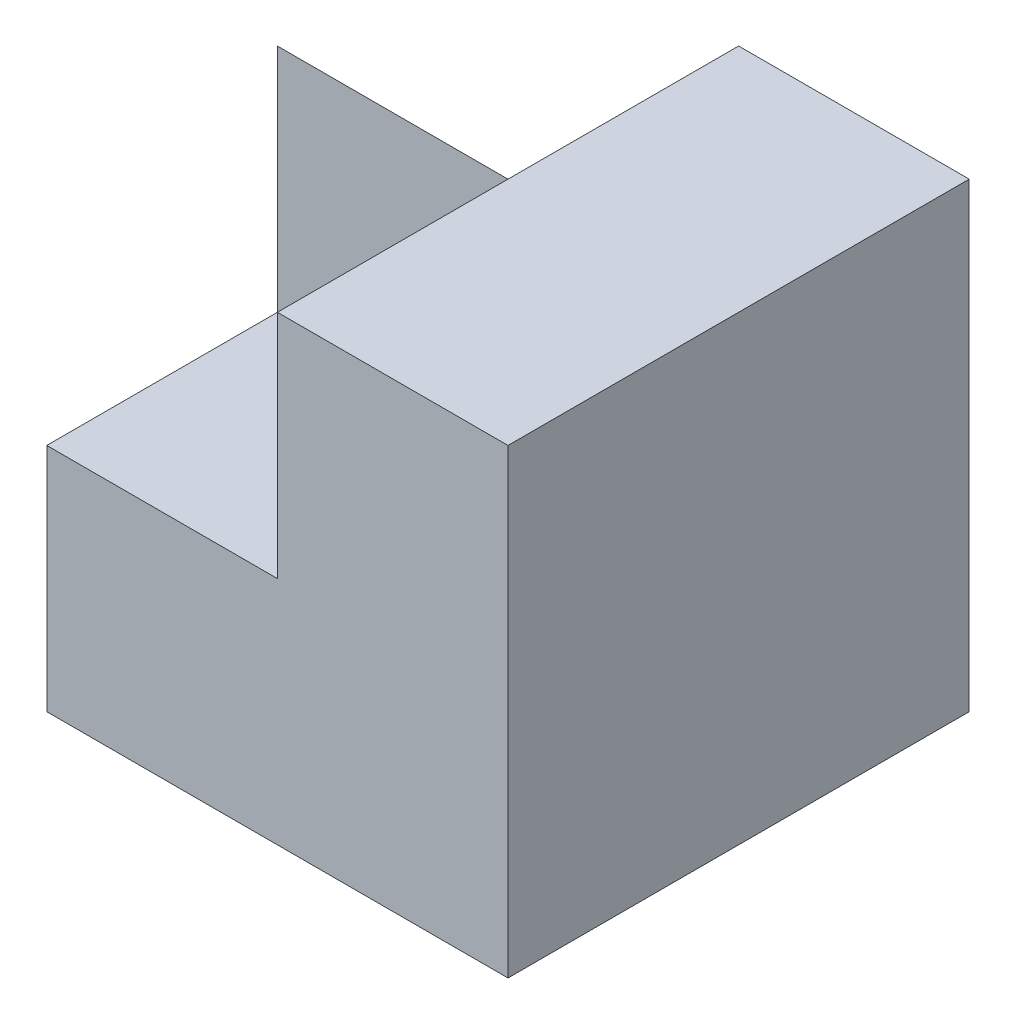
ISO-10303-21;
HEADER;
FILE_DESCRIPTION(('STEP AP214'),'2;1');
FILE_NAME('part.step','',(''),(''),'','','');
FILE_SCHEMA(('AUTOMOTIVE_DESIGN { 1 0 10303 214 1 1 1 1 }'));
ENDSEC;
DATA;
#1=APPLICATION_CONTEXT('core data for automotive mechanical design processes');
#2=APPLICATION_PROTOCOL_DEFINITION('international standard','automotive_design',2000,#1);
#3=PRODUCT_CONTEXT('',#1,'mechanical');
#4=PRODUCT('Part','Part','',(#3));
#5=PRODUCT_RELATED_PRODUCT_CATEGORY('part','',(#4));
#6=PRODUCT_DEFINITION_FORMATION('','',#4);
#7=PRODUCT_DEFINITION_CONTEXT('part definition',#1,'design');
#8=PRODUCT_DEFINITION('design','',#6,#7);
#9=PRODUCT_DEFINITION_SHAPE('','',#8);
#10=(LENGTH_UNIT() NAMED_UNIT(*) SI_UNIT(.MILLI.,.METRE.));
#11=(NAMED_UNIT(*) PLANE_ANGLE_UNIT() SI_UNIT($,.RADIAN.));
#12=(NAMED_UNIT(*) SI_UNIT($,.STERADIAN.) SOLID_ANGLE_UNIT());
#13=UNCERTAINTY_MEASURE_WITH_UNIT(LENGTH_MEASURE(1.E-05),#10,'distance_accuracy_value','');
#14=(GEOMETRIC_REPRESENTATION_CONTEXT(3) GLOBAL_UNCERTAINTY_ASSIGNED_CONTEXT((#13)) GLOBAL_UNIT_ASSIGNED_CONTEXT((#10,
#11,#12)) REPRESENTATION_CONTEXT('',''));
#15=CARTESIAN_POINT('',(0.,0.,0.));
#16=DIRECTION('',(0.,0.,1.));
#17=DIRECTION('',(1.,0.,0.));
#18=AXIS2_PLACEMENT_3D('',#15,#16,#17);
#19=CARTESIAN_POINT('',(0.,4.,0.));
#20=DIRECTION('',(0.,-1.,0.));
#21=DIRECTION('',(0.,0.,-1.));
#22=AXIS2_PLACEMENT_3D('',#19,#20,#21);
#23=PLANE('',#22);
#24=DIRECTION('',(0.,0.,-1.));
#25=VECTOR('',#24,1.);
#26=CARTESIAN_POINT('',(0.,4.,0.));
#27=LINE('',#26,#25);
#28=CARTESIAN_POINT('',(0.,4.,2.));
#29=VERTEX_POINT('',#28);
#30=CARTESIAN_POINT('',(0.,4.,0.));
#31=VERTEX_POINT('',#30);
#32=EDGE_CURVE('E68',#29,#31,#27,.T.);
#33=ORIENTED_EDGE('',*,*,#32,.F.);
#34=DIRECTION('',(1.,0.,0.));
#35=VECTOR('',#34,1.);
#36=CARTESIAN_POINT('',(-2.,4.,2.));
#37=LINE('',#36,#35);
#38=CARTESIAN_POINT('',(2.,4.,2.));
#39=VERTEX_POINT('',#38);
#40=EDGE_CURVE('E76',#29,#39,#37,.T.);
#41=ORIENTED_EDGE('',*,*,#40,.T.);
#42=DIRECTION('',(0.,0.,-1.));
#43=VECTOR('',#42,1.);
#44=CARTESIAN_POINT('',(2.,4.,2.));
#45=LINE('',#44,#43);
#46=CARTESIAN_POINT('',(2.,4.,-2.));
#47=VERTEX_POINT('',#46);
#48=EDGE_CURVE('E108',#39,#47,#45,.T.);
#49=ORIENTED_EDGE('',*,*,#48,.T.);
#50=DIRECTION('',(-1.,0.,0.));
#51=VECTOR('',#50,1.);
#52=CARTESIAN_POINT('',(-2.,4.,-2.));
#53=LINE('',#52,#51);
#54=CARTESIAN_POINT('',(0.,4.,-2.));
#55=VERTEX_POINT('',#54);
#56=EDGE_CURVE('E143',#47,#55,#53,.T.);
#57=ORIENTED_EDGE('',*,*,#56,.T.);
#58=DIRECTION('',(0.,0.,-1.));
#59=VECTOR('',#58,1.);
#60=CARTESIAN_POINT('',(0.,4.,0.));
#61=LINE('',#60,#59);
#62=EDGE_CURVE('E150',#31,#55,#61,.T.);
#63=ORIENTED_EDGE('',*,*,#62,.F.);
#64=EDGE_LOOP('',(#33,#41,#49,#57,#63));
#65=FACE_BOUND('',#64,.T.);
#66=ADVANCED_FACE('F53',(#65),#23,.F.);
#67=CARTESIAN_POINT('',(2.,4.,2.));
#68=DIRECTION('',(-1.,0.,0.));
#69=DIRECTION('',(0.,0.,1.));
#70=AXIS2_PLACEMENT_3D('',#67,#68,#69);
#71=PLANE('',#70);
#72=DIRECTION('',(0.,0.,-1.));
#73=VECTOR('',#72,1.);
#74=CARTESIAN_POINT('',(2.,0.,2.));
#75=LINE('',#74,#73);
#76=CARTESIAN_POINT('',(2.,0.,2.));
#77=VERTEX_POINT('',#76);
#78=CARTESIAN_POINT('',(2.,0.,-2.));
#79=VERTEX_POINT('',#78);
#80=EDGE_CURVE('E114',#77,#79,#75,.T.);
#81=ORIENTED_EDGE('',*,*,#80,.T.);
#82=DIRECTION('',(0.,-1.,0.));
#83=VECTOR('',#82,1.);
#84=CARTESIAN_POINT('',(2.,4.,-2.));
#85=LINE('',#84,#83);
#86=EDGE_CURVE('E12',#47,#79,#85,.T.);
#87=ORIENTED_EDGE('',*,*,#86,.F.);
#88=ORIENTED_EDGE('',*,*,#48,.F.);
#89=DIRECTION('',(0.,-1.,0.));
#90=VECTOR('',#89,1.);
#91=CARTESIAN_POINT('',(2.,4.,2.));
#92=LINE('',#91,#90);
#93=EDGE_CURVE('E99',#39,#77,#92,.T.);
#94=ORIENTED_EDGE('',*,*,#93,.T.);
#95=EDGE_LOOP('',(#81,#87,#88,#94));
#96=FACE_BOUND('',#95,.T.);
#97=ADVANCED_FACE('F55',(#96),#71,.F.);
#98=CARTESIAN_POINT('',(-2.,4.,-2.));
#99=DIRECTION('',(0.,0.,1.));
#100=DIRECTION('',(1.,0.,0.));
#101=AXIS2_PLACEMENT_3D('',#98,#99,#100);
#102=PLANE('',#101);
#103=DIRECTION('',(0.,-1.,0.));
#104=VECTOR('',#103,1.);
#105=CARTESIAN_POINT('',(-2.,4.,-2.));
#106=LINE('',#105,#104);
#107=CARTESIAN_POINT('',(-2.,2.,-2.));
#108=VERTEX_POINT('',#107);
#109=CARTESIAN_POINT('',(-2.,0.,-2.));
#110=VERTEX_POINT('',#109);
#111=EDGE_CURVE('E61',#108,#110,#106,.T.);
#112=ORIENTED_EDGE('',*,*,#111,.F.);
#113=DIRECTION('',(-1.,0.,0.));
#114=VECTOR('',#113,1.);
#115=CARTESIAN_POINT('',(0.,2.,-2.));
#116=LINE('',#115,#114);
#117=CARTESIAN_POINT('',(0.,2.,-2.));
#118=VERTEX_POINT('',#117);
#119=EDGE_CURVE('E123',#118,#108,#116,.T.);
#120=ORIENTED_EDGE('',*,*,#119,.F.);
#121=DIRECTION('',(0.,-1.,0.));
#122=VECTOR('',#121,1.);
#123=CARTESIAN_POINT('',(0.,0.,-2.));
#124=LINE('',#123,#122);
#125=EDGE_CURVE('E145',#55,#118,#124,.T.);
#126=ORIENTED_EDGE('',*,*,#125,.F.);
#127=ORIENTED_EDGE('',*,*,#56,.F.);
#128=ORIENTED_EDGE('',*,*,#86,.T.);
#129=DIRECTION('',(-1.,0.,0.));
#130=VECTOR('',#129,1.);
#131=CARTESIAN_POINT('',(-2.,0.,-2.));
#132=LINE('',#131,#130);
#133=EDGE_CURVE('E118',#79,#110,#132,.T.);
#134=ORIENTED_EDGE('',*,*,#133,.T.);
#135=EDGE_LOOP('',(#112,#120,#126,#127,#128,#134));
#136=FACE_BOUND('',#135,.T.);
#137=ADVANCED_FACE('F140',(#136),#102,.F.);
#138=CARTESIAN_POINT('',(-2.,4.,2.));
#139=DIRECTION('',(1.,0.,0.));
#140=DIRECTION('',(0.,0.,-1.));
#141=AXIS2_PLACEMENT_3D('',#138,#139,#140);
#142=PLANE('',#141);
#143=DIRECTION('',(0.,0.,1.));
#144=VECTOR('',#143,1.);
#145=CARTESIAN_POINT('',(-2.,2.,0.));
#146=LINE('',#145,#144);
#147=CARTESIAN_POINT('',(-2.,2.,0.));
#148=VERTEX_POINT('',#147);
#149=CARTESIAN_POINT('',(-2.,2.,2.));
#150=VERTEX_POINT('',#149);
#151=EDGE_CURVE('E164',#148,#150,#146,.T.);
#152=ORIENTED_EDGE('',*,*,#151,.F.);
#153=DIRECTION('',(0.,-1.,0.));
#154=VECTOR('',#153,1.);
#155=CARTESIAN_POINT('',(-2.,0.,0.));
#156=LINE('',#155,#154);
#157=CARTESIAN_POINT('',(-2.,4.,0.));
#158=VERTEX_POINT('',#157);
#159=EDGE_CURVE('E168',#158,#148,#156,.T.);
#160=ORIENTED_EDGE('',*,*,#159,.F.);
#161=DIRECTION('',(0.,0.707106781186548,0.707106781186548));
#162=VECTOR('',#161,1.);
#163=CARTESIAN_POINT('',(-2.,2.,-2.));
#164=LINE('',#163,#162);
#165=EDGE_CURVE('E137',#108,#158,#164,.T.);
#166=ORIENTED_EDGE('',*,*,#165,.F.);
#167=ORIENTED_EDGE('',*,*,#111,.T.);
#168=DIRECTION('',(0.,0.,1.));
#169=VECTOR('',#168,1.);
#170=CARTESIAN_POINT('',(-2.,0.,2.));
#171=LINE('',#170,#169);
#172=CARTESIAN_POINT('',(-2.,0.,2.));
#173=VERTEX_POINT('',#172);
#174=EDGE_CURVE('E109',#110,#173,#171,.T.);
#175=ORIENTED_EDGE('',*,*,#174,.T.);
#176=DIRECTION('',(0.,-1.,0.));
#177=VECTOR('',#176,1.);
#178=CARTESIAN_POINT('',(-2.,4.,2.));
#179=LINE('',#178,#177);
#180=EDGE_CURVE('E103',#150,#173,#179,.T.);
#181=ORIENTED_EDGE('',*,*,#180,.F.);
#182=EDGE_LOOP('',(#152,#160,#166,#167,#175,#181));
#183=FACE_BOUND('',#182,.T.);
#184=ADVANCED_FACE('F133',(#183),#142,.F.);
#185=CARTESIAN_POINT('',(-2.,4.,2.));
#186=DIRECTION('',(0.,0.,-1.));
#187=DIRECTION('',(-1.,0.,0.));
#188=AXIS2_PLACEMENT_3D('',#185,#186,#187);
#189=PLANE('',#188);
#190=DIRECTION('',(0.,1.,0.));
#191=VECTOR('',#190,1.);
#192=CARTESIAN_POINT('',(0.,0.,2.));
#193=LINE('',#192,#191);
#194=CARTESIAN_POINT('',(0.,2.,2.));
#195=VERTEX_POINT('',#194);
#196=EDGE_CURVE('E172',#195,#29,#193,.T.);
#197=ORIENTED_EDGE('',*,*,#196,.F.);
#198=DIRECTION('',(-1.,0.,0.));
#199=VECTOR('',#198,1.);
#200=CARTESIAN_POINT('',(0.,2.,2.));
#201=LINE('',#200,#199);
#202=EDGE_CURVE('E153',#195,#150,#201,.T.);
#203=ORIENTED_EDGE('',*,*,#202,.T.);
#204=ORIENTED_EDGE('',*,*,#180,.T.);
#205=DIRECTION('',(1.,0.,0.));
#206=VECTOR('',#205,1.);
#207=CARTESIAN_POINT('',(-2.,0.,2.));
#208=LINE('',#207,#206);
#209=EDGE_CURVE('E95',#173,#77,#208,.T.);
#210=ORIENTED_EDGE('',*,*,#209,.T.);
#211=ORIENTED_EDGE('',*,*,#93,.F.);
#212=ORIENTED_EDGE('',*,*,#40,.F.);
#213=EDGE_LOOP('',(#197,#203,#204,#210,#211,#212));
#214=FACE_BOUND('',#213,.T.);
#215=ADVANCED_FACE('F98',(#214),#189,.F.);
#216=CARTESIAN_POINT('',(0.,0.,0.));
#217=DIRECTION('',(0.,-1.,0.));
#218=DIRECTION('',(0.,0.,-1.));
#219=AXIS2_PLACEMENT_3D('',#216,#217,#218);
#220=PLANE('',#219);
#221=ORIENTED_EDGE('',*,*,#80,.F.);
#222=ORIENTED_EDGE('',*,*,#209,.F.);
#223=ORIENTED_EDGE('',*,*,#174,.F.);
#224=ORIENTED_EDGE('',*,*,#133,.F.);
#225=EDGE_LOOP('',(#221,#222,#223,#224));
#226=FACE_BOUND('',#225,.T.);
#227=ADVANCED_FACE('F116',(#226),#220,.T.);
#228=CARTESIAN_POINT('',(0.,2.,-2.));
#229=DIRECTION('',(0.,-0.707106781186547,0.707106781186547));
#230=DIRECTION('',(0.,-0.707106781186548,-0.707106781186548));
#231=AXIS2_PLACEMENT_3D('',#228,#229,#230);
#232=PLANE('',#231);
#233=ORIENTED_EDGE('',*,*,#165,.T.);
#234=DIRECTION('',(-1.,0.,0.));
#235=VECTOR('',#234,1.);
#236=CARTESIAN_POINT('',(0.,4.,0.));
#237=LINE('',#236,#235);
#238=EDGE_CURVE('E119',#31,#158,#237,.T.);
#239=ORIENTED_EDGE('',*,*,#238,.F.);
#240=DIRECTION('',(0.,0.707106781186548,0.707106781186548));
#241=VECTOR('',#240,1.);
#242=CARTESIAN_POINT('',(0.,2.,-2.));
#243=LINE('',#242,#241);
#244=EDGE_CURVE('E156',#118,#31,#243,.T.);
#245=ORIENTED_EDGE('',*,*,#244,.F.);
#246=ORIENTED_EDGE('',*,*,#119,.T.);
#247=EDGE_LOOP('',(#233,#239,#245,#246));
#248=FACE_BOUND('',#247,.T.);
#249=ADVANCED_FACE('F192',(#248),#232,.F.);
#250=CARTESIAN_POINT('',(0.,0.,0.));
#251=DIRECTION('',(-1.,0.,0.));
#252=DIRECTION('',(0.,0.,1.));
#253=AXIS2_PLACEMENT_3D('',#250,#251,#252);
#254=PLANE('',#253);
#255=ORIENTED_EDGE('',*,*,#125,.T.);
#256=ORIENTED_EDGE('',*,*,#244,.T.);
#257=ORIENTED_EDGE('',*,*,#62,.T.);
#258=EDGE_LOOP('',(#255,#256,#257));
#259=FACE_BOUND('',#258,.T.);
#260=ADVANCED_FACE('F189',(#259),#254,.T.);
#261=CARTESIAN_POINT('',(0.,0.,0.));
#262=DIRECTION('',(0.,0.,-1.));
#263=DIRECTION('',(-1.,0.,0.));
#264=AXIS2_PLACEMENT_3D('',#261,#262,#263);
#265=PLANE('',#264);
#266=ORIENTED_EDGE('',*,*,#159,.T.);
#267=DIRECTION('',(-1.,0.,0.));
#268=VECTOR('',#267,1.);
#269=CARTESIAN_POINT('',(0.,2.,0.));
#270=LINE('',#269,#268);
#271=CARTESIAN_POINT('',(0.,2.,0.));
#272=VERTEX_POINT('',#271);
#273=EDGE_CURVE('E160',#272,#148,#270,.T.);
#274=ORIENTED_EDGE('',*,*,#273,.F.);
#275=DIRECTION('',(0.,-1.,0.));
#276=VECTOR('',#275,1.);
#277=CARTESIAN_POINT('',(0.,0.,0.));
#278=LINE('',#277,#276);
#279=EDGE_CURVE('E167',#31,#272,#278,.T.);
#280=ORIENTED_EDGE('',*,*,#279,.F.);
#281=ORIENTED_EDGE('',*,*,#238,.T.);
#282=EDGE_LOOP('',(#266,#274,#280,#281));
#283=FACE_BOUND('',#282,.T.);
#284=ADVANCED_FACE('F185',(#283),#265,.F.);
#285=CARTESIAN_POINT('',(0.,2.,0.));
#286=DIRECTION('',(0.,-1.,0.));
#287=DIRECTION('',(0.,0.,-1.));
#288=AXIS2_PLACEMENT_3D('',#285,#286,#287);
#289=PLANE('',#288);
#290=ORIENTED_EDGE('',*,*,#151,.T.);
#291=ORIENTED_EDGE('',*,*,#202,.F.);
#292=DIRECTION('',(0.,0.,1.));
#293=VECTOR('',#292,1.);
#294=CARTESIAN_POINT('',(0.,2.,0.));
#295=LINE('',#294,#293);
#296=EDGE_CURVE('E174',#272,#195,#295,.T.);
#297=ORIENTED_EDGE('',*,*,#296,.F.);
#298=ORIENTED_EDGE('',*,*,#273,.T.);
#299=EDGE_LOOP('',(#290,#291,#297,#298));
#300=FACE_BOUND('',#299,.T.);
#301=ADVANCED_FACE('F205',(#300),#289,.F.);
#302=CARTESIAN_POINT('',(0.,0.,0.));
#303=DIRECTION('',(-1.,0.,0.));
#304=DIRECTION('',(0.,0.,1.));
#305=AXIS2_PLACEMENT_3D('',#302,#303,#304);
#306=PLANE('',#305);
#307=ORIENTED_EDGE('',*,*,#279,.T.);
#308=ORIENTED_EDGE('',*,*,#296,.T.);
#309=ORIENTED_EDGE('',*,*,#196,.T.);
#310=ORIENTED_EDGE('',*,*,#32,.T.);
#311=EDGE_LOOP('',(#307,#308,#309,#310));
#312=FACE_BOUND('',#311,.T.);
#313=ADVANCED_FACE('F178',(#312),#306,.T.);
#314=CLOSED_SHELL('',(#66,#97,#137,#184,#215,#227,#249,#260,#284,#301,#313));
#315=MANIFOLD_SOLID_BREP('B2',#314);
#316=ADVANCED_BREP_SHAPE_REPRESENTATION('',(#18,#315),#14);
#317=SHAPE_DEFINITION_REPRESENTATION(#9,#316);
ENDSEC;
END-ISO-10303-21;
